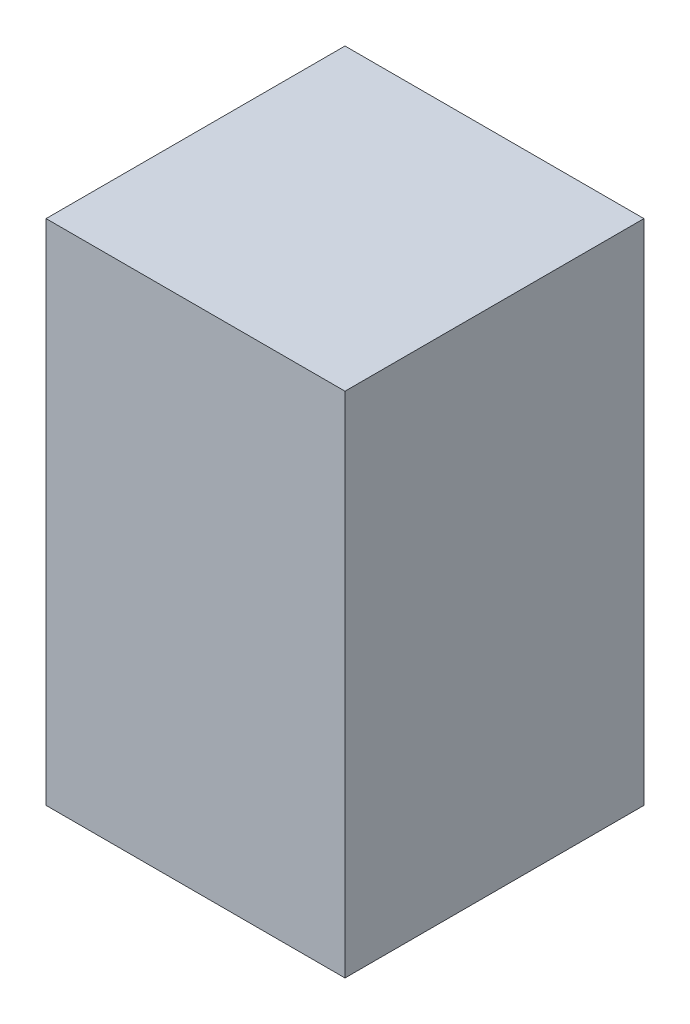
ISO-10303-21;
HEADER;
FILE_DESCRIPTION(('STEP AP214'),'2;1');
FILE_NAME('part.step','',(''),(''),'','','');
FILE_SCHEMA(('AUTOMOTIVE_DESIGN { 1 0 10303 214 1 1 1 1 }'));
ENDSEC;
DATA;
#1=APPLICATION_CONTEXT('core data for automotive mechanical design processes');
#2=APPLICATION_PROTOCOL_DEFINITION('international standard','automotive_design',2000,#1);
#3=PRODUCT_CONTEXT('',#1,'mechanical');
#4=PRODUCT('Part','Part','',(#3));
#5=PRODUCT_RELATED_PRODUCT_CATEGORY('part','',(#4));
#6=PRODUCT_DEFINITION_FORMATION('','',#4);
#7=PRODUCT_DEFINITION_CONTEXT('part definition',#1,'design');
#8=PRODUCT_DEFINITION('design','',#6,#7);
#9=PRODUCT_DEFINITION_SHAPE('','',#8);
#10=(LENGTH_UNIT() NAMED_UNIT(*) SI_UNIT(.MILLI.,.METRE.));
#11=(NAMED_UNIT(*) PLANE_ANGLE_UNIT() SI_UNIT($,.RADIAN.));
#12=(NAMED_UNIT(*) SI_UNIT($,.STERADIAN.) SOLID_ANGLE_UNIT());
#13=UNCERTAINTY_MEASURE_WITH_UNIT(LENGTH_MEASURE(1.E-05),#10,'distance_accuracy_value','');
#14=(GEOMETRIC_REPRESENTATION_CONTEXT(3) GLOBAL_UNCERTAINTY_ASSIGNED_CONTEXT((#13)) GLOBAL_UNIT_ASSIGNED_CONTEXT((#10,
#11,#12)) REPRESENTATION_CONTEXT('',''));
#15=CARTESIAN_POINT('',(0.,0.,0.));
#16=DIRECTION('',(0.,0.,1.));
#17=DIRECTION('',(1.,0.,0.));
#18=AXIS2_PLACEMENT_3D('',#15,#16,#17);
#19=CARTESIAN_POINT('',(0.2499995,0.42500042,0.));
#20=DIRECTION('',(1.,0.,0.));
#21=DIRECTION('',(0.,0.,-1.));
#22=AXIS2_PLACEMENT_3D('',#19,#20,#21);
#23=PLANE('',#22);
#24=DIRECTION('',(0.,0.,-1.));
#25=VECTOR('',#24,1.);
#26=CARTESIAN_POINT('',(0.2499995,-0.42500042,0.));
#27=LINE('',#26,#25);
#28=CARTESIAN_POINT('',(0.2499995,-0.42500042,0.));
#29=VERTEX_POINT('',#28);
#30=CARTESIAN_POINT('',(0.2499995,-0.42500042,0.499999));
#31=VERTEX_POINT('',#30);
#32=EDGE_CURVE('E20',#29,#31,#27,.F.);
#33=ORIENTED_EDGE('',*,*,#32,.F.);
#34=DIRECTION('',(0.,1.,0.));
#35=VECTOR('',#34,1.);
#36=CARTESIAN_POINT('',(0.2499995,-0.42500042,0.));
#37=LINE('',#36,#35);
#38=CARTESIAN_POINT('',(0.2499995,0.42500042,0.));
#39=VERTEX_POINT('',#38);
#40=EDGE_CURVE('E80',#29,#39,#37,.T.);
#41=ORIENTED_EDGE('',*,*,#40,.T.);
#42=DIRECTION('',(0.,0.,1.));
#43=VECTOR('',#42,1.);
#44=CARTESIAN_POINT('',(0.2499995,0.42500042,0.));
#45=LINE('',#44,#43);
#46=CARTESIAN_POINT('',(0.2499995,0.42500042,0.499999));
#47=VERTEX_POINT('',#46);
#48=EDGE_CURVE('E68',#47,#39,#45,.F.);
#49=ORIENTED_EDGE('',*,*,#48,.F.);
#50=DIRECTION('',(0.,1.,0.));
#51=VECTOR('',#50,1.);
#52=CARTESIAN_POINT('',(0.2499995,-0.42500042,0.499999));
#53=LINE('',#52,#51);
#54=EDGE_CURVE('E56',#31,#47,#53,.T.);
#55=ORIENTED_EDGE('',*,*,#54,.F.);
#56=EDGE_LOOP('',(#33,#41,#49,#55));
#57=FACE_BOUND('',#56,.T.);
#58=ADVANCED_FACE('F17',(#57),#23,.T.);
#59=CARTESIAN_POINT('',(0.2499995,-0.42500042,0.));
#60=DIRECTION('',(0.,-1.,0.));
#61=DIRECTION('',(0.,0.,-1.));
#62=AXIS2_PLACEMENT_3D('',#59,#60,#61);
#63=PLANE('',#62);
#64=DIRECTION('',(0.,0.,1.));
#65=VECTOR('',#64,1.);
#66=CARTESIAN_POINT('',(-0.2499995,-0.42500042,0.));
#67=LINE('',#66,#65);
#68=CARTESIAN_POINT('',(-0.2499995,-0.42500042,0.));
#69=VERTEX_POINT('',#68);
#70=CARTESIAN_POINT('',(-0.2499995,-0.42500042,0.499999));
#71=VERTEX_POINT('',#70);
#72=EDGE_CURVE('E83',#69,#71,#67,.T.);
#73=ORIENTED_EDGE('',*,*,#72,.F.);
#74=DIRECTION('',(1.,0.,0.));
#75=VECTOR('',#74,1.);
#76=CARTESIAN_POINT('',(-0.2499995,-0.42500042,0.));
#77=LINE('',#76,#75);
#78=EDGE_CURVE('E65',#69,#29,#77,.T.);
#79=ORIENTED_EDGE('',*,*,#78,.T.);
#80=ORIENTED_EDGE('',*,*,#32,.T.);
#81=DIRECTION('',(1.,0.,0.));
#82=VECTOR('',#81,1.);
#83=CARTESIAN_POINT('',(-0.2499995,-0.42500042,0.499999));
#84=LINE('',#83,#82);
#85=EDGE_CURVE('E62',#71,#31,#84,.T.);
#86=ORIENTED_EDGE('',*,*,#85,.F.);
#87=EDGE_LOOP('',(#73,#79,#80,#86));
#88=FACE_BOUND('',#87,.T.);
#89=ADVANCED_FACE('F61',(#88),#63,.T.);
#90=CARTESIAN_POINT('',(-0.2499995,-0.42500042,0.499999));
#91=DIRECTION('',(0.,0.,1.));
#92=DIRECTION('',(1.,0.,0.));
#93=AXIS2_PLACEMENT_3D('',#90,#91,#92);
#94=PLANE('',#93);
#95=DIRECTION('',(1.,0.,0.));
#96=VECTOR('',#95,1.);
#97=CARTESIAN_POINT('',(-0.2499995,0.42500042,0.499999));
#98=LINE('',#97,#96);
#99=CARTESIAN_POINT('',(-0.2499995,0.42500042,0.499999));
#100=VERTEX_POINT('',#99);
#101=EDGE_CURVE('E70',#100,#47,#98,.T.);
#102=ORIENTED_EDGE('',*,*,#101,.F.);
#103=DIRECTION('',(0.,1.,0.));
#104=VECTOR('',#103,1.);
#105=CARTESIAN_POINT('',(-0.2499995,-0.42500042,0.499999));
#106=LINE('',#105,#104);
#107=EDGE_CURVE('E74',#71,#100,#106,.T.);
#108=ORIENTED_EDGE('',*,*,#107,.F.);
#109=ORIENTED_EDGE('',*,*,#85,.T.);
#110=ORIENTED_EDGE('',*,*,#54,.T.);
#111=EDGE_LOOP('',(#102,#108,#109,#110));
#112=FACE_BOUND('',#111,.T.);
#113=ADVANCED_FACE('F72',(#112),#94,.T.);
#114=CARTESIAN_POINT('',(-0.2499995,0.42500042,0.));
#115=DIRECTION('',(0.,1.,0.));
#116=DIRECTION('',(0.,0.,1.));
#117=AXIS2_PLACEMENT_3D('',#114,#115,#116);
#118=PLANE('',#117);
#119=ORIENTED_EDGE('',*,*,#48,.T.);
#120=DIRECTION('',(1.,0.,0.));
#121=VECTOR('',#120,1.);
#122=CARTESIAN_POINT('',(-0.2499995,0.42500042,0.));
#123=LINE('',#122,#121);
#124=CARTESIAN_POINT('',(-0.2499995,0.42500042,0.));
#125=VERTEX_POINT('',#124);
#126=EDGE_CURVE('E35',#39,#125,#123,.F.);
#127=ORIENTED_EDGE('',*,*,#126,.T.);
#128=DIRECTION('',(0.,0.,1.));
#129=VECTOR('',#128,1.);
#130=CARTESIAN_POINT('',(-0.2499995,0.42500042,0.));
#131=LINE('',#130,#129);
#132=EDGE_CURVE('E26',#100,#125,#131,.F.);
#133=ORIENTED_EDGE('',*,*,#132,.F.);
#134=ORIENTED_EDGE('',*,*,#101,.T.);
#135=EDGE_LOOP('',(#119,#127,#133,#134));
#136=FACE_BOUND('',#135,.T.);
#137=ADVANCED_FACE('F89',(#136),#118,.T.);
#138=CARTESIAN_POINT('',(-0.2499995,-0.42500042,0.));
#139=DIRECTION('',(0.,0.,1.));
#140=DIRECTION('',(1.,0.,0.));
#141=AXIS2_PLACEMENT_3D('',#138,#139,#140);
#142=PLANE('',#141);
#143=ORIENTED_EDGE('',*,*,#126,.F.);
#144=ORIENTED_EDGE('',*,*,#40,.F.);
#145=ORIENTED_EDGE('',*,*,#78,.F.);
#146=DIRECTION('',(0.,1.,0.));
#147=VECTOR('',#146,1.);
#148=CARTESIAN_POINT('',(-0.2499995,-0.42500042,0.));
#149=LINE('',#148,#147);
#150=EDGE_CURVE('E11',#125,#69,#149,.F.);
#151=ORIENTED_EDGE('',*,*,#150,.F.);
#152=EDGE_LOOP('',(#143,#144,#145,#151));
#153=FACE_BOUND('',#152,.T.);
#154=ADVANCED_FACE('F91',(#153),#142,.F.);
#155=CARTESIAN_POINT('',(-0.2499995,-0.42500042,0.));
#156=DIRECTION('',(-1.,0.,0.));
#157=DIRECTION('',(0.,0.,1.));
#158=AXIS2_PLACEMENT_3D('',#155,#156,#157);
#159=PLANE('',#158);
#160=ORIENTED_EDGE('',*,*,#132,.T.);
#161=ORIENTED_EDGE('',*,*,#150,.T.);
#162=ORIENTED_EDGE('',*,*,#72,.T.);
#163=ORIENTED_EDGE('',*,*,#107,.T.);
#164=EDGE_LOOP('',(#160,#161,#162,#163));
#165=FACE_BOUND('',#164,.T.);
#166=ADVANCED_FACE('F88',(#165),#159,.T.);
#167=CLOSED_SHELL('',(#58,#89,#113,#137,#154,#166));
#168=MANIFOLD_SOLID_BREP('B1',#167);
#169=ADVANCED_BREP_SHAPE_REPRESENTATION('',(#18,#168),#14);
#170=SHAPE_DEFINITION_REPRESENTATION(#9,#169);
ENDSEC;
END-ISO-10303-21;
